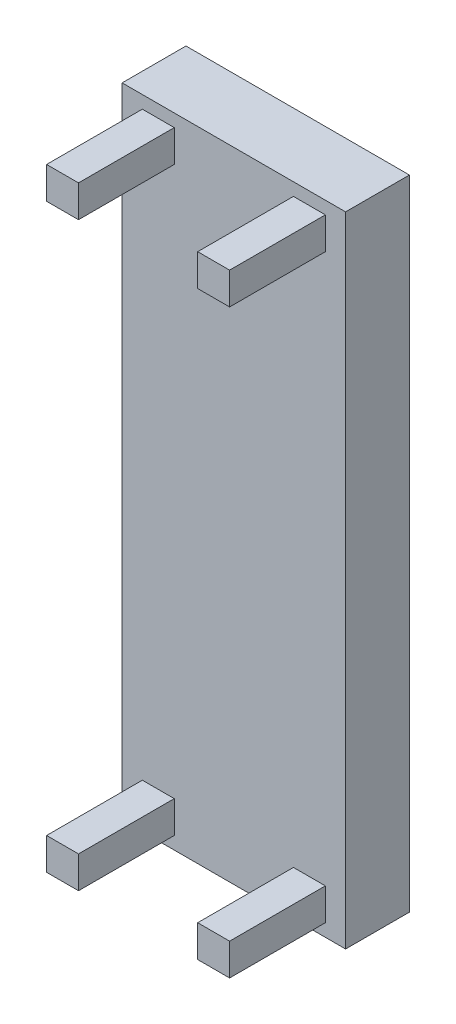
ISO-10303-21;
HEADER;
FILE_DESCRIPTION(('STEP AP214'),'2;1');
FILE_NAME('part.step','',(''),(''),'','','');
FILE_SCHEMA(('AUTOMOTIVE_DESIGN { 1 0 10303 214 1 1 1 1 }'));
ENDSEC;
DATA;
#1=APPLICATION_CONTEXT('core data for automotive mechanical design processes');
#2=APPLICATION_PROTOCOL_DEFINITION('international standard','automotive_design',2000,#1);
#3=PRODUCT_CONTEXT('',#1,'mechanical');
#4=PRODUCT('Part','Part','',(#3));
#5=PRODUCT_RELATED_PRODUCT_CATEGORY('part','',(#4));
#6=PRODUCT_DEFINITION_FORMATION('','',#4);
#7=PRODUCT_DEFINITION_CONTEXT('part definition',#1,'design');
#8=PRODUCT_DEFINITION('design','',#6,#7);
#9=PRODUCT_DEFINITION_SHAPE('','',#8);
#10=(LENGTH_UNIT() NAMED_UNIT(*) SI_UNIT(.MILLI.,.METRE.));
#11=(NAMED_UNIT(*) PLANE_ANGLE_UNIT() SI_UNIT($,.RADIAN.));
#12=(NAMED_UNIT(*) SI_UNIT($,.STERADIAN.) SOLID_ANGLE_UNIT());
#13=UNCERTAINTY_MEASURE_WITH_UNIT(LENGTH_MEASURE(1.E-05),#10,'distance_accuracy_value','');
#14=(GEOMETRIC_REPRESENTATION_CONTEXT(3) GLOBAL_UNCERTAINTY_ASSIGNED_CONTEXT((#13)) GLOBAL_UNIT_ASSIGNED_CONTEXT((#10,
#11,#12)) REPRESENTATION_CONTEXT('',''));
#15=CARTESIAN_POINT('',(0.,0.,0.));
#16=DIRECTION('',(0.,0.,1.));
#17=DIRECTION('',(1.,0.,0.));
#18=AXIS2_PLACEMENT_3D('',#15,#16,#17);
#19=CARTESIAN_POINT('',(0.,0.,200.));
#20=DIRECTION('',(0.,0.,-1.));
#21=DIRECTION('',(-1.,0.,0.));
#22=AXIS2_PLACEMENT_3D('',#19,#20,#21);
#23=PLANE('',#22);
#24=DIRECTION('',(0.,1.,0.));
#25=VECTOR('',#24,1.);
#26=CARTESIAN_POINT('',(286.693905306388,-960.285310824153,200.));
#27=LINE('',#26,#25);
#28=CARTESIAN_POINT('',(286.693905306388,-960.285310824153,200.));
#29=VERTEX_POINT('',#28);
#30=CARTESIAN_POINT('',(286.693905306388,-860.285310824153,200.));
#31=VERTEX_POINT('',#30);
#32=EDGE_CURVE('E227',#29,#31,#27,.T.);
#33=ORIENTED_EDGE('',*,*,#32,.F.);
#34=DIRECTION('',(1.,0.,0.));
#35=VECTOR('',#34,1.);
#36=CARTESIAN_POINT('',(286.693905306388,-960.285310824153,200.));
#37=LINE('',#36,#35);
#38=CARTESIAN_POINT('',(186.693905306388,-960.285310824153,200.));
#39=VERTEX_POINT('',#38);
#40=EDGE_CURVE('E217',#39,#29,#37,.T.);
#41=ORIENTED_EDGE('',*,*,#40,.F.);
#42=DIRECTION('',(0.,-1.,0.));
#43=VECTOR('',#42,1.);
#44=CARTESIAN_POINT('',(186.693905306388,-960.285310824153,200.));
#45=LINE('',#44,#43);
#46=CARTESIAN_POINT('',(186.693905306388,-860.285310824153,200.));
#47=VERTEX_POINT('',#46);
#48=EDGE_CURVE('E220',#47,#39,#45,.T.);
#49=ORIENTED_EDGE('',*,*,#48,.F.);
#50=DIRECTION('',(-1.,0.,0.));
#51=VECTOR('',#50,1.);
#52=CARTESIAN_POINT('',(286.693905306388,-860.285310824153,200.));
#53=LINE('',#52,#51);
#54=EDGE_CURVE('E224',#31,#47,#53,.T.);
#55=ORIENTED_EDGE('',*,*,#54,.F.);
#56=EDGE_LOOP('',(#33,#41,#49,#55));
#57=FACE_BOUND('',#56,.T.);
#58=DIRECTION('',(0.,1.,0.));
#59=VECTOR('',#58,1.);
#60=CARTESIAN_POINT('',(-186.693905306388,960.285310824153,200.));
#61=LINE('',#60,#59);
#62=CARTESIAN_POINT('',(-186.693905306388,860.285310824153,200.));
#63=VERTEX_POINT('',#62);
#64=CARTESIAN_POINT('',(-186.693905306388,960.285310824153,200.));
#65=VERTEX_POINT('',#64);
#66=EDGE_CURVE('E263',#63,#65,#61,.T.);
#67=ORIENTED_EDGE('',*,*,#66,.F.);
#68=DIRECTION('',(1.,0.,0.));
#69=VECTOR('',#68,1.);
#70=CARTESIAN_POINT('',(-286.693905306388,860.285310824153,200.));
#71=LINE('',#70,#69);
#72=CARTESIAN_POINT('',(-286.693905306388,860.285310824153,200.));
#73=VERTEX_POINT('',#72);
#74=EDGE_CURVE('E275',#73,#63,#71,.T.);
#75=ORIENTED_EDGE('',*,*,#74,.F.);
#76=DIRECTION('',(0.,-1.,0.));
#77=VECTOR('',#76,1.);
#78=CARTESIAN_POINT('',(-286.693905306388,960.285310824153,200.));
#79=LINE('',#78,#77);
#80=CARTESIAN_POINT('',(-286.693905306388,960.285310824153,200.));
#81=VERTEX_POINT('',#80);
#82=EDGE_CURVE('E287',#81,#73,#79,.T.);
#83=ORIENTED_EDGE('',*,*,#82,.F.);
#84=DIRECTION('',(-1.,0.,0.));
#85=VECTOR('',#84,1.);
#86=CARTESIAN_POINT('',(-286.693905306388,960.285310824153,200.));
#87=LINE('',#86,#85);
#88=EDGE_CURVE('E284',#65,#81,#87,.T.);
#89=ORIENTED_EDGE('',*,*,#88,.F.);
#90=EDGE_LOOP('',(#67,#75,#83,#89));
#91=FACE_BOUND('',#90,.T.);
#92=DIRECTION('',(0.,1.,0.));
#93=VECTOR('',#92,1.);
#94=CARTESIAN_POINT('',(350.,-1000.,200.));
#95=LINE('',#94,#93);
#96=CARTESIAN_POINT('',(350.,-1000.,200.));
#97=VERTEX_POINT('',#96);
#98=CARTESIAN_POINT('',(350.,1000.,200.));
#99=VERTEX_POINT('',#98);
#100=EDGE_CURVE('E304',#97,#99,#95,.T.);
#101=ORIENTED_EDGE('',*,*,#100,.T.);
#102=DIRECTION('',(-1.,0.,0.));
#103=VECTOR('',#102,1.);
#104=CARTESIAN_POINT('',(-350.,1000.,200.));
#105=LINE('',#104,#103);
#106=CARTESIAN_POINT('',(-350.,1000.,200.));
#107=VERTEX_POINT('',#106);
#108=EDGE_CURVE('E307',#99,#107,#105,.T.);
#109=ORIENTED_EDGE('',*,*,#108,.T.);
#110=DIRECTION('',(0.,-1.,0.));
#111=VECTOR('',#110,1.);
#112=CARTESIAN_POINT('',(-350.,-1000.,200.));
#113=LINE('',#112,#111);
#114=CARTESIAN_POINT('',(-350.,-1000.,200.));
#115=VERTEX_POINT('',#114);
#116=EDGE_CURVE('E310',#107,#115,#113,.T.);
#117=ORIENTED_EDGE('',*,*,#116,.T.);
#118=DIRECTION('',(1.,0.,0.));
#119=VECTOR('',#118,1.);
#120=CARTESIAN_POINT('',(-350.,-1000.,200.));
#121=LINE('',#120,#119);
#122=EDGE_CURVE('E312',#115,#97,#121,.T.);
#123=ORIENTED_EDGE('',*,*,#122,.T.);
#124=EDGE_LOOP('',(#101,#109,#117,#123));
#125=FACE_BOUND('',#124,.T.);
#126=DIRECTION('',(0.,1.,0.));
#127=VECTOR('',#126,1.);
#128=CARTESIAN_POINT('',(286.693905306388,960.285310824153,200.));
#129=LINE('',#128,#127);
#130=CARTESIAN_POINT('',(286.693905306388,860.285310824153,200.));
#131=VERTEX_POINT('',#130);
#132=CARTESIAN_POINT('',(286.693905306388,960.285310824153,200.));
#133=VERTEX_POINT('',#132);
#134=EDGE_CURVE('E260',#131,#133,#129,.T.);
#135=ORIENTED_EDGE('',*,*,#134,.F.);
#136=DIRECTION('',(1.,0.,0.));
#137=VECTOR('',#136,1.);
#138=CARTESIAN_POINT('',(286.693905306388,860.285310824153,200.));
#139=LINE('',#138,#137);
#140=CARTESIAN_POINT('',(186.693905306388,860.285310824153,200.));
#141=VERTEX_POINT('',#140);
#142=EDGE_CURVE('E250',#141,#131,#139,.T.);
#143=ORIENTED_EDGE('',*,*,#142,.F.);
#144=DIRECTION('',(0.,-1.,0.));
#145=VECTOR('',#144,1.);
#146=CARTESIAN_POINT('',(186.693905306388,960.285310824153,200.));
#147=LINE('',#146,#145);
#148=CARTESIAN_POINT('',(186.693905306388,960.285310824153,200.));
#149=VERTEX_POINT('',#148);
#150=EDGE_CURVE('E253',#149,#141,#147,.T.);
#151=ORIENTED_EDGE('',*,*,#150,.F.);
#152=DIRECTION('',(-1.,0.,0.));
#153=VECTOR('',#152,1.);
#154=CARTESIAN_POINT('',(286.693905306388,960.285310824153,200.));
#155=LINE('',#154,#153);
#156=EDGE_CURVE('E257',#133,#149,#155,.T.);
#157=ORIENTED_EDGE('',*,*,#156,.F.);
#158=EDGE_LOOP('',(#135,#143,#151,#157));
#159=FACE_BOUND('',#158,.T.);
#160=DIRECTION('',(0.,-1.,0.));
#161=VECTOR('',#160,1.);
#162=CARTESIAN_POINT('',(-286.693905306388,-960.285310824153,200.));
#163=LINE('',#162,#161);
#164=CARTESIAN_POINT('',(-286.693905306388,-860.285310824153,200.));
#165=VERTEX_POINT('',#164);
#166=CARTESIAN_POINT('',(-286.693905306388,-960.285310824153,200.));
#167=VERTEX_POINT('',#166);
#168=EDGE_CURVE('E170',#165,#167,#163,.T.);
#169=ORIENTED_EDGE('',*,*,#168,.F.);
#170=DIRECTION('',(-1.,0.,0.));
#171=VECTOR('',#170,1.);
#172=CARTESIAN_POINT('',(-286.693905306388,-860.285310824153,200.));
#173=LINE('',#172,#171);
#174=CARTESIAN_POINT('',(-186.693905306388,-860.285310824153,200.));
#175=VERTEX_POINT('',#174);
#176=EDGE_CURVE('E172',#175,#165,#173,.T.);
#177=ORIENTED_EDGE('',*,*,#176,.F.);
#178=DIRECTION('',(0.,1.,0.));
#179=VECTOR('',#178,1.);
#180=CARTESIAN_POINT('',(-186.693905306388,-960.285310824153,200.));
#181=LINE('',#180,#179);
#182=CARTESIAN_POINT('',(-186.693905306388,-960.285310824153,200.));
#183=VERTEX_POINT('',#182);
#184=EDGE_CURVE('E57',#183,#175,#181,.T.);
#185=ORIENTED_EDGE('',*,*,#184,.F.);
#186=DIRECTION('',(1.,0.,0.));
#187=VECTOR('',#186,1.);
#188=CARTESIAN_POINT('',(-286.693905306388,-960.285310824153,200.));
#189=LINE('',#188,#187);
#190=EDGE_CURVE('E52',#167,#183,#189,.T.);
#191=ORIENTED_EDGE('',*,*,#190,.F.);
#192=EDGE_LOOP('',(#169,#177,#185,#191));
#193=FACE_BOUND('',#192,.T.);
#194=ADVANCED_FACE('F37',(#57,#91,#125,#159,#193),#23,.F.);
#195=CARTESIAN_POINT('',(350.,-1000.,200.));
#196=DIRECTION('',(-1.,0.,0.));
#197=DIRECTION('',(0.,0.,1.));
#198=AXIS2_PLACEMENT_3D('',#195,#196,#197);
#199=PLANE('',#198);
#200=DIRECTION('',(0.,1.,0.));
#201=VECTOR('',#200,1.);
#202=CARTESIAN_POINT('',(350.,-1000.,0.));
#203=LINE('',#202,#201);
#204=CARTESIAN_POINT('',(350.,-1000.,0.));
#205=VERTEX_POINT('',#204);
#206=CARTESIAN_POINT('',(350.,1000.,0.));
#207=VERTEX_POINT('',#206);
#208=EDGE_CURVE('E303',#205,#207,#203,.T.);
#209=ORIENTED_EDGE('',*,*,#208,.T.);
#210=DIRECTION('',(0.,0.,-1.));
#211=VECTOR('',#210,1.);
#212=CARTESIAN_POINT('',(350.,1000.,200.));
#213=LINE('',#212,#211);
#214=EDGE_CURVE('E11',#99,#207,#213,.T.);
#215=ORIENTED_EDGE('',*,*,#214,.F.);
#216=ORIENTED_EDGE('',*,*,#100,.F.);
#217=DIRECTION('',(0.,0.,-1.));
#218=VECTOR('',#217,1.);
#219=CARTESIAN_POINT('',(350.,-1000.,200.));
#220=LINE('',#219,#218);
#221=EDGE_CURVE('E314',#97,#205,#220,.T.);
#222=ORIENTED_EDGE('',*,*,#221,.T.);
#223=EDGE_LOOP('',(#209,#215,#216,#222));
#224=FACE_BOUND('',#223,.T.);
#225=ADVANCED_FACE('F39',(#224),#199,.F.);
#226=CARTESIAN_POINT('',(-350.,1000.,200.));
#227=DIRECTION('',(0.,-1.,0.));
#228=DIRECTION('',(0.,0.,-1.));
#229=AXIS2_PLACEMENT_3D('',#226,#227,#228);
#230=PLANE('',#229);
#231=DIRECTION('',(-1.,0.,0.));
#232=VECTOR('',#231,1.);
#233=CARTESIAN_POINT('',(-350.,1000.,0.));
#234=LINE('',#233,#232);
#235=CARTESIAN_POINT('',(-350.,1000.,0.));
#236=VERTEX_POINT('',#235);
#237=EDGE_CURVE('E317',#207,#236,#234,.T.);
#238=ORIENTED_EDGE('',*,*,#237,.T.);
#239=DIRECTION('',(0.,0.,-1.));
#240=VECTOR('',#239,1.);
#241=CARTESIAN_POINT('',(-350.,1000.,200.));
#242=LINE('',#241,#240);
#243=EDGE_CURVE('E45',#107,#236,#242,.T.);
#244=ORIENTED_EDGE('',*,*,#243,.F.);
#245=ORIENTED_EDGE('',*,*,#108,.F.);
#246=ORIENTED_EDGE('',*,*,#214,.T.);
#247=EDGE_LOOP('',(#238,#244,#245,#246));
#248=FACE_BOUND('',#247,.T.);
#249=ADVANCED_FACE('F347',(#248),#230,.F.);
#250=CARTESIAN_POINT('',(-350.,-1000.,200.));
#251=DIRECTION('',(1.,0.,0.));
#252=DIRECTION('',(0.,0.,-1.));
#253=AXIS2_PLACEMENT_3D('',#250,#251,#252);
#254=PLANE('',#253);
#255=DIRECTION('',(0.,-1.,0.));
#256=VECTOR('',#255,1.);
#257=CARTESIAN_POINT('',(-350.,-1000.,0.));
#258=LINE('',#257,#256);
#259=CARTESIAN_POINT('',(-350.,-1000.,0.));
#260=VERTEX_POINT('',#259);
#261=EDGE_CURVE('E319',#236,#260,#258,.T.);
#262=ORIENTED_EDGE('',*,*,#261,.T.);
#263=DIRECTION('',(0.,0.,-1.));
#264=VECTOR('',#263,1.);
#265=CARTESIAN_POINT('',(-350.,-1000.,200.));
#266=LINE('',#265,#264);
#267=EDGE_CURVE('E324',#115,#260,#266,.T.);
#268=ORIENTED_EDGE('',*,*,#267,.F.);
#269=ORIENTED_EDGE('',*,*,#116,.F.);
#270=ORIENTED_EDGE('',*,*,#243,.T.);
#271=EDGE_LOOP('',(#262,#268,#269,#270));
#272=FACE_BOUND('',#271,.T.);
#273=ADVANCED_FACE('F331',(#272),#254,.F.);
#274=CARTESIAN_POINT('',(-350.,-1000.,200.));
#275=DIRECTION('',(0.,1.,0.));
#276=DIRECTION('',(0.,0.,1.));
#277=AXIS2_PLACEMENT_3D('',#274,#275,#276);
#278=PLANE('',#277);
#279=DIRECTION('',(1.,0.,0.));
#280=VECTOR('',#279,1.);
#281=CARTESIAN_POINT('',(-350.,-1000.,0.));
#282=LINE('',#281,#280);
#283=EDGE_CURVE('E308',#260,#205,#282,.T.);
#284=ORIENTED_EDGE('',*,*,#283,.T.);
#285=ORIENTED_EDGE('',*,*,#221,.F.);
#286=ORIENTED_EDGE('',*,*,#122,.F.);
#287=ORIENTED_EDGE('',*,*,#267,.T.);
#288=EDGE_LOOP('',(#284,#285,#286,#287));
#289=FACE_BOUND('',#288,.T.);
#290=ADVANCED_FACE('F340',(#289),#278,.F.);
#291=CARTESIAN_POINT('',(0.,0.,0.));
#292=DIRECTION('',(0.,0.,-1.));
#293=DIRECTION('',(-1.,0.,0.));
#294=AXIS2_PLACEMENT_3D('',#291,#292,#293);
#295=PLANE('',#294);
#296=ORIENTED_EDGE('',*,*,#208,.F.);
#297=ORIENTED_EDGE('',*,*,#283,.F.);
#298=ORIENTED_EDGE('',*,*,#261,.F.);
#299=ORIENTED_EDGE('',*,*,#237,.F.);
#300=EDGE_LOOP('',(#296,#297,#298,#299));
#301=FACE_BOUND('',#300,.T.);
#302=ADVANCED_FACE('F337',(#301),#295,.T.);
#303=CARTESIAN_POINT('',(-186.693905306388,960.285310824153,500.));
#304=DIRECTION('',(-1.,0.,0.));
#305=DIRECTION('',(0.,0.,1.));
#306=AXIS2_PLACEMENT_3D('',#303,#304,#305);
#307=PLANE('',#306);
#308=ORIENTED_EDGE('',*,*,#66,.T.);
#309=DIRECTION('',(0.,0.,-1.));
#310=VECTOR('',#309,1.);
#311=CARTESIAN_POINT('',(-186.693905306388,960.285310824153,500.));
#312=LINE('',#311,#310);
#313=CARTESIAN_POINT('',(-186.693905306388,960.285310824153,500.));
#314=VERTEX_POINT('',#313);
#315=EDGE_CURVE('E300',#314,#65,#312,.T.);
#316=ORIENTED_EDGE('',*,*,#315,.F.);
#317=DIRECTION('',(0.,1.,0.));
#318=VECTOR('',#317,1.);
#319=CARTESIAN_POINT('',(-186.693905306388,960.285310824153,500.));
#320=LINE('',#319,#318);
#321=CARTESIAN_POINT('',(-186.693905306388,860.285310824153,500.));
#322=VERTEX_POINT('',#321);
#323=EDGE_CURVE('E271',#322,#314,#320,.T.);
#324=ORIENTED_EDGE('',*,*,#323,.F.);
#325=DIRECTION('',(0.,0.,-1.));
#326=VECTOR('',#325,1.);
#327=CARTESIAN_POINT('',(-186.693905306388,860.285310824153,500.));
#328=LINE('',#327,#326);
#329=EDGE_CURVE('E281',#322,#63,#328,.T.);
#330=ORIENTED_EDGE('',*,*,#329,.T.);
#331=EDGE_LOOP('',(#308,#316,#324,#330));
#332=FACE_BOUND('',#331,.T.);
#333=ADVANCED_FACE('F362',(#332),#307,.F.);
#334=CARTESIAN_POINT('',(-286.693905306388,960.285310824153,500.));
#335=DIRECTION('',(0.,-1.,0.));
#336=DIRECTION('',(0.,0.,-1.));
#337=AXIS2_PLACEMENT_3D('',#334,#335,#336);
#338=PLANE('',#337);
#339=ORIENTED_EDGE('',*,*,#88,.T.);
#340=DIRECTION('',(0.,0.,-1.));
#341=VECTOR('',#340,1.);
#342=CARTESIAN_POINT('',(-286.693905306388,960.285310824153,500.));
#343=LINE('',#342,#341);
#344=CARTESIAN_POINT('',(-286.693905306388,960.285310824153,500.));
#345=VERTEX_POINT('',#344);
#346=EDGE_CURVE('E297',#345,#81,#343,.T.);
#347=ORIENTED_EDGE('',*,*,#346,.F.);
#348=DIRECTION('',(-1.,0.,0.));
#349=VECTOR('',#348,1.);
#350=CARTESIAN_POINT('',(-286.693905306388,960.285310824153,500.));
#351=LINE('',#350,#349);
#352=EDGE_CURVE('E274',#314,#345,#351,.T.);
#353=ORIENTED_EDGE('',*,*,#352,.F.);
#354=ORIENTED_EDGE('',*,*,#315,.T.);
#355=EDGE_LOOP('',(#339,#347,#353,#354));
#356=FACE_BOUND('',#355,.T.);
#357=ADVANCED_FACE('F381',(#356),#338,.F.);
#358=CARTESIAN_POINT('',(-286.693905306388,960.285310824153,500.));
#359=DIRECTION('',(1.,0.,0.));
#360=DIRECTION('',(0.,0.,-1.));
#361=AXIS2_PLACEMENT_3D('',#358,#359,#360);
#362=PLANE('',#361);
#363=ORIENTED_EDGE('',*,*,#82,.T.);
#364=DIRECTION('',(0.,0.,-1.));
#365=VECTOR('',#364,1.);
#366=CARTESIAN_POINT('',(-286.693905306388,860.285310824153,500.));
#367=LINE('',#366,#365);
#368=CARTESIAN_POINT('',(-286.693905306388,860.285310824153,500.));
#369=VERTEX_POINT('',#368);
#370=EDGE_CURVE('E294',#369,#73,#367,.T.);
#371=ORIENTED_EDGE('',*,*,#370,.F.);
#372=DIRECTION('',(0.,-1.,0.));
#373=VECTOR('',#372,1.);
#374=CARTESIAN_POINT('',(-286.693905306388,960.285310824153,500.));
#375=LINE('',#374,#373);
#376=EDGE_CURVE('E277',#345,#369,#375,.T.);
#377=ORIENTED_EDGE('',*,*,#376,.F.);
#378=ORIENTED_EDGE('',*,*,#346,.T.);
#379=EDGE_LOOP('',(#363,#371,#377,#378));
#380=FACE_BOUND('',#379,.T.);
#381=ADVANCED_FACE('F388',(#380),#362,.F.);
#382=CARTESIAN_POINT('',(-286.693905306388,860.285310824153,500.));
#383=DIRECTION('',(0.,1.,0.));
#384=DIRECTION('',(0.,0.,1.));
#385=AXIS2_PLACEMENT_3D('',#382,#383,#384);
#386=PLANE('',#385);
#387=ORIENTED_EDGE('',*,*,#74,.T.);
#388=ORIENTED_EDGE('',*,*,#329,.F.);
#389=DIRECTION('',(1.,0.,0.));
#390=VECTOR('',#389,1.);
#391=CARTESIAN_POINT('',(-286.693905306388,860.285310824153,500.));
#392=LINE('',#391,#390);
#393=EDGE_CURVE('E279',#369,#322,#392,.T.);
#394=ORIENTED_EDGE('',*,*,#393,.F.);
#395=ORIENTED_EDGE('',*,*,#370,.T.);
#396=EDGE_LOOP('',(#387,#388,#394,#395));
#397=FACE_BOUND('',#396,.T.);
#398=ADVANCED_FACE('F395',(#397),#386,.F.);
#399=CARTESIAN_POINT('',(0.,0.,500.));
#400=DIRECTION('',(0.,0.,1.));
#401=DIRECTION('',(1.,0.,0.));
#402=AXIS2_PLACEMENT_3D('',#399,#400,#401);
#403=PLANE('',#402);
#404=ORIENTED_EDGE('',*,*,#323,.T.);
#405=ORIENTED_EDGE('',*,*,#352,.T.);
#406=ORIENTED_EDGE('',*,*,#376,.T.);
#407=ORIENTED_EDGE('',*,*,#393,.T.);
#408=EDGE_LOOP('',(#404,#405,#406,#407));
#409=FACE_BOUND('',#408,.T.);
#410=ADVANCED_FACE('F403',(#409),#403,.T.);
#411=CARTESIAN_POINT('',(286.693905306388,960.285310824153,500.));
#412=DIRECTION('',(-1.,0.,0.));
#413=DIRECTION('',(0.,0.,1.));
#414=AXIS2_PLACEMENT_3D('',#411,#412,#413);
#415=PLANE('',#414);
#416=ORIENTED_EDGE('',*,*,#134,.T.);
#417=DIRECTION('',(0.,0.,-1.));
#418=VECTOR('',#417,1.);
#419=CARTESIAN_POINT('',(286.693905306388,960.285310824153,500.));
#420=LINE('',#419,#418);
#421=CARTESIAN_POINT('',(286.693905306388,960.285310824153,500.));
#422=VERTEX_POINT('',#421);
#423=EDGE_CURVE('E230',#422,#133,#420,.T.);
#424=ORIENTED_EDGE('',*,*,#423,.F.);
#425=DIRECTION('',(0.,1.,0.));
#426=VECTOR('',#425,1.);
#427=CARTESIAN_POINT('',(286.693905306388,960.285310824153,500.));
#428=LINE('',#427,#426);
#429=CARTESIAN_POINT('',(286.693905306388,860.285310824153,500.));
#430=VERTEX_POINT('',#429);
#431=EDGE_CURVE('E254',#430,#422,#428,.T.);
#432=ORIENTED_EDGE('',*,*,#431,.F.);
#433=DIRECTION('',(0.,0.,-1.));
#434=VECTOR('',#433,1.);
#435=CARTESIAN_POINT('',(286.693905306388,860.285310824153,500.));
#436=LINE('',#435,#434);
#437=EDGE_CURVE('E246',#430,#131,#436,.T.);
#438=ORIENTED_EDGE('',*,*,#437,.T.);
#439=EDGE_LOOP('',(#416,#424,#432,#438));
#440=FACE_BOUND('',#439,.T.);
#441=ADVANCED_FACE('F411',(#440),#415,.F.);
#442=CARTESIAN_POINT('',(286.693905306388,960.285310824153,500.));
#443=DIRECTION('',(0.,-1.,0.));
#444=DIRECTION('',(0.,0.,-1.));
#445=AXIS2_PLACEMENT_3D('',#442,#443,#444);
#446=PLANE('',#445);
#447=ORIENTED_EDGE('',*,*,#156,.T.);
#448=DIRECTION('',(0.,0.,-1.));
#449=VECTOR('',#448,1.);
#450=CARTESIAN_POINT('',(186.693905306388,960.285310824153,500.));
#451=LINE('',#450,#449);
#452=CARTESIAN_POINT('',(186.693905306388,960.285310824153,500.));
#453=VERTEX_POINT('',#452);
#454=EDGE_CURVE('E240',#453,#149,#451,.T.);
#455=ORIENTED_EDGE('',*,*,#454,.F.);
#456=DIRECTION('',(-1.,0.,0.));
#457=VECTOR('',#456,1.);
#458=CARTESIAN_POINT('',(286.693905306388,960.285310824153,500.));
#459=LINE('',#458,#457);
#460=EDGE_CURVE('E267',#422,#453,#459,.T.);
#461=ORIENTED_EDGE('',*,*,#460,.F.);
#462=ORIENTED_EDGE('',*,*,#423,.T.);
#463=EDGE_LOOP('',(#447,#455,#461,#462));
#464=FACE_BOUND('',#463,.T.);
#465=ADVANCED_FACE('F419',(#464),#446,.F.);
#466=CARTESIAN_POINT('',(186.693905306388,960.285310824153,500.));
#467=DIRECTION('',(1.,0.,0.));
#468=DIRECTION('',(0.,0.,-1.));
#469=AXIS2_PLACEMENT_3D('',#466,#467,#468);
#470=PLANE('',#469);
#471=ORIENTED_EDGE('',*,*,#150,.T.);
#472=DIRECTION('',(0.,0.,-1.));
#473=VECTOR('',#472,1.);
#474=CARTESIAN_POINT('',(186.693905306388,860.285310824153,500.));
#475=LINE('',#474,#473);
#476=CARTESIAN_POINT('',(186.693905306388,860.285310824153,500.));
#477=VERTEX_POINT('',#476);
#478=EDGE_CURVE('E243',#477,#141,#475,.T.);
#479=ORIENTED_EDGE('',*,*,#478,.F.);
#480=DIRECTION('',(0.,-1.,0.));
#481=VECTOR('',#480,1.);
#482=CARTESIAN_POINT('',(186.693905306388,960.285310824153,500.));
#483=LINE('',#482,#481);
#484=EDGE_CURVE('E265',#453,#477,#483,.T.);
#485=ORIENTED_EDGE('',*,*,#484,.F.);
#486=ORIENTED_EDGE('',*,*,#454,.T.);
#487=EDGE_LOOP('',(#471,#479,#485,#486));
#488=FACE_BOUND('',#487,.T.);
#489=ADVANCED_FACE('F427',(#488),#470,.F.);
#490=CARTESIAN_POINT('',(286.693905306388,860.285310824153,500.));
#491=DIRECTION('',(0.,1.,0.));
#492=DIRECTION('',(0.,0.,1.));
#493=AXIS2_PLACEMENT_3D('',#490,#491,#492);
#494=PLANE('',#493);
#495=ORIENTED_EDGE('',*,*,#142,.T.);
#496=ORIENTED_EDGE('',*,*,#437,.F.);
#497=DIRECTION('',(1.,0.,0.));
#498=VECTOR('',#497,1.);
#499=CARTESIAN_POINT('',(286.693905306388,860.285310824153,500.));
#500=LINE('',#499,#498);
#501=EDGE_CURVE('E249',#477,#430,#500,.T.);
#502=ORIENTED_EDGE('',*,*,#501,.F.);
#503=ORIENTED_EDGE('',*,*,#478,.T.);
#504=EDGE_LOOP('',(#495,#496,#502,#503));
#505=FACE_BOUND('',#504,.T.);
#506=ADVANCED_FACE('F435',(#505),#494,.F.);
#507=CARTESIAN_POINT('',(0.,0.,500.));
#508=DIRECTION('',(0.,0.,-1.));
#509=DIRECTION('',(-1.,0.,0.));
#510=AXIS2_PLACEMENT_3D('',#507,#508,#509);
#511=PLANE('',#510);
#512=ORIENTED_EDGE('',*,*,#431,.T.);
#513=ORIENTED_EDGE('',*,*,#460,.T.);
#514=ORIENTED_EDGE('',*,*,#484,.T.);
#515=ORIENTED_EDGE('',*,*,#501,.T.);
#516=EDGE_LOOP('',(#512,#513,#514,#515));
#517=FACE_BOUND('',#516,.T.);
#518=ADVANCED_FACE('F443',(#517),#511,.F.);
#519=CARTESIAN_POINT('',(286.693905306388,-960.285310824153,500.));
#520=DIRECTION('',(-1.,0.,0.));
#521=DIRECTION('',(0.,0.,1.));
#522=AXIS2_PLACEMENT_3D('',#519,#520,#521);
#523=PLANE('',#522);
#524=ORIENTED_EDGE('',*,*,#32,.T.);
#525=DIRECTION('',(0.,0.,-1.));
#526=VECTOR('',#525,1.);
#527=CARTESIAN_POINT('',(286.693905306388,-860.285310824153,500.));
#528=LINE('',#527,#526);
#529=CARTESIAN_POINT('',(286.693905306388,-860.285310824153,500.));
#530=VERTEX_POINT('',#529);
#531=EDGE_CURVE('E176',#530,#31,#528,.T.);
#532=ORIENTED_EDGE('',*,*,#531,.F.);
#533=DIRECTION('',(0.,1.,0.));
#534=VECTOR('',#533,1.);
#535=CARTESIAN_POINT('',(286.693905306388,-960.285310824153,500.));
#536=LINE('',#535,#534);
#537=CARTESIAN_POINT('',(286.693905306388,-960.285310824153,500.));
#538=VERTEX_POINT('',#537);
#539=EDGE_CURVE('E221',#538,#530,#536,.T.);
#540=ORIENTED_EDGE('',*,*,#539,.F.);
#541=DIRECTION('',(0.,0.,-1.));
#542=VECTOR('',#541,1.);
#543=CARTESIAN_POINT('',(286.693905306388,-960.285310824153,500.));
#544=LINE('',#543,#542);
#545=EDGE_CURVE('E213',#538,#29,#544,.T.);
#546=ORIENTED_EDGE('',*,*,#545,.T.);
#547=EDGE_LOOP('',(#524,#532,#540,#546));
#548=FACE_BOUND('',#547,.T.);
#549=ADVANCED_FACE('F451',(#548),#523,.F.);
#550=CARTESIAN_POINT('',(286.693905306388,-860.285310824153,500.));
#551=DIRECTION('',(0.,-1.,0.));
#552=DIRECTION('',(0.,0.,-1.));
#553=AXIS2_PLACEMENT_3D('',#550,#551,#552);
#554=PLANE('',#553);
#555=ORIENTED_EDGE('',*,*,#54,.T.);
#556=DIRECTION('',(0.,0.,-1.));
#557=VECTOR('',#556,1.);
#558=CARTESIAN_POINT('',(186.693905306388,-860.285310824153,500.));
#559=LINE('',#558,#557);
#560=CARTESIAN_POINT('',(186.693905306388,-860.285310824153,500.));
#561=VERTEX_POINT('',#560);
#562=EDGE_CURVE('E207',#561,#47,#559,.T.);
#563=ORIENTED_EDGE('',*,*,#562,.F.);
#564=DIRECTION('',(-1.,0.,0.));
#565=VECTOR('',#564,1.);
#566=CARTESIAN_POINT('',(286.693905306388,-860.285310824153,500.));
#567=LINE('',#566,#565);
#568=EDGE_CURVE('E234',#530,#561,#567,.T.);
#569=ORIENTED_EDGE('',*,*,#568,.F.);
#570=ORIENTED_EDGE('',*,*,#531,.T.);
#571=EDGE_LOOP('',(#555,#563,#569,#570));
#572=FACE_BOUND('',#571,.T.);
#573=ADVANCED_FACE('F459',(#572),#554,.F.);
#574=CARTESIAN_POINT('',(186.693905306388,-960.285310824153,500.));
#575=DIRECTION('',(1.,0.,0.));
#576=DIRECTION('',(0.,0.,-1.));
#577=AXIS2_PLACEMENT_3D('',#574,#575,#576);
#578=PLANE('',#577);
#579=ORIENTED_EDGE('',*,*,#48,.T.);
#580=DIRECTION('',(0.,0.,-1.));
#581=VECTOR('',#580,1.);
#582=CARTESIAN_POINT('',(186.693905306388,-960.285310824153,500.));
#583=LINE('',#582,#581);
#584=CARTESIAN_POINT('',(186.693905306388,-960.285310824153,500.));
#585=VERTEX_POINT('',#584);
#586=EDGE_CURVE('E210',#585,#39,#583,.T.);
#587=ORIENTED_EDGE('',*,*,#586,.F.);
#588=DIRECTION('',(0.,-1.,0.));
#589=VECTOR('',#588,1.);
#590=CARTESIAN_POINT('',(186.693905306388,-960.285310824153,500.));
#591=LINE('',#590,#589);
#592=EDGE_CURVE('E232',#561,#585,#591,.T.);
#593=ORIENTED_EDGE('',*,*,#592,.F.);
#594=ORIENTED_EDGE('',*,*,#562,.T.);
#595=EDGE_LOOP('',(#579,#587,#593,#594));
#596=FACE_BOUND('',#595,.T.);
#597=ADVANCED_FACE('F467',(#596),#578,.F.);
#598=CARTESIAN_POINT('',(286.693905306388,-960.285310824153,500.));
#599=DIRECTION('',(0.,1.,0.));
#600=DIRECTION('',(0.,0.,1.));
#601=AXIS2_PLACEMENT_3D('',#598,#599,#600);
#602=PLANE('',#601);
#603=ORIENTED_EDGE('',*,*,#40,.T.);
#604=ORIENTED_EDGE('',*,*,#545,.F.);
#605=DIRECTION('',(1.,0.,0.));
#606=VECTOR('',#605,1.);
#607=CARTESIAN_POINT('',(286.693905306388,-960.285310824153,500.));
#608=LINE('',#607,#606);
#609=EDGE_CURVE('E216',#585,#538,#608,.T.);
#610=ORIENTED_EDGE('',*,*,#609,.F.);
#611=ORIENTED_EDGE('',*,*,#586,.T.);
#612=EDGE_LOOP('',(#603,#604,#610,#611));
#613=FACE_BOUND('',#612,.T.);
#614=ADVANCED_FACE('F475',(#613),#602,.F.);
#615=CARTESIAN_POINT('',(0.,0.,500.));
#616=DIRECTION('',(0.,0.,1.));
#617=DIRECTION('',(1.,0.,0.));
#618=AXIS2_PLACEMENT_3D('',#615,#616,#617);
#619=PLANE('',#618);
#620=ORIENTED_EDGE('',*,*,#539,.T.);
#621=ORIENTED_EDGE('',*,*,#568,.T.);
#622=ORIENTED_EDGE('',*,*,#592,.T.);
#623=ORIENTED_EDGE('',*,*,#609,.T.);
#624=EDGE_LOOP('',(#620,#621,#622,#623));
#625=FACE_BOUND('',#624,.T.);
#626=ADVANCED_FACE('F483',(#625),#619,.T.);
#627=CARTESIAN_POINT('',(-286.693905306388,-960.285310824153,500.));
#628=DIRECTION('',(1.,0.,0.));
#629=DIRECTION('',(0.,0.,-1.));
#630=AXIS2_PLACEMENT_3D('',#627,#628,#629);
#631=PLANE('',#630);
#632=ORIENTED_EDGE('',*,*,#168,.T.);
#633=DIRECTION('',(0.,0.,-1.));
#634=VECTOR('',#633,1.);
#635=CARTESIAN_POINT('',(-286.693905306388,-960.285310824153,500.));
#636=LINE('',#635,#634);
#637=CARTESIAN_POINT('',(-286.693905306388,-960.285310824153,500.));
#638=VERTEX_POINT('',#637);
#639=EDGE_CURVE('E645',#638,#167,#636,.T.);
#640=ORIENTED_EDGE('',*,*,#639,.F.);
#641=DIRECTION('',(0.,-1.,0.));
#642=VECTOR('',#641,1.);
#643=CARTESIAN_POINT('',(-286.693905306388,-960.285310824153,500.));
#644=LINE('',#643,#642);
#645=CARTESIAN_POINT('',(-286.693905306388,-860.285310824153,500.));
#646=VERTEX_POINT('',#645);
#647=EDGE_CURVE('E187',#646,#638,#644,.T.);
#648=ORIENTED_EDGE('',*,*,#647,.F.);
#649=DIRECTION('',(0.,0.,-1.));
#650=VECTOR('',#649,1.);
#651=CARTESIAN_POINT('',(-286.693905306388,-860.285310824153,500.));
#652=LINE('',#651,#650);
#653=EDGE_CURVE('E183',#646,#165,#652,.T.);
#654=ORIENTED_EDGE('',*,*,#653,.T.);
#655=EDGE_LOOP('',(#632,#640,#648,#654));
#656=FACE_BOUND('',#655,.T.);
#657=ADVANCED_FACE('F189',(#656),#631,.F.);
#658=CARTESIAN_POINT('',(-286.693905306388,-960.285310824153,500.));
#659=DIRECTION('',(0.,1.,0.));
#660=DIRECTION('',(0.,0.,1.));
#661=AXIS2_PLACEMENT_3D('',#658,#659,#660);
#662=PLANE('',#661);
#663=ORIENTED_EDGE('',*,*,#190,.T.);
#664=DIRECTION('',(0.,0.,-1.));
#665=VECTOR('',#664,1.);
#666=CARTESIAN_POINT('',(-186.693905306388,-960.285310824153,500.));
#667=LINE('',#666,#665);
#668=CARTESIAN_POINT('',(-186.693905306388,-960.285310824153,500.));
#669=VERTEX_POINT('',#668);
#670=EDGE_CURVE('E195',#669,#183,#667,.T.);
#671=ORIENTED_EDGE('',*,*,#670,.F.);
#672=DIRECTION('',(1.,0.,0.));
#673=VECTOR('',#672,1.);
#674=CARTESIAN_POINT('',(-286.693905306388,-960.285310824153,500.));
#675=LINE('',#674,#673);
#676=EDGE_CURVE('E202',#638,#669,#675,.T.);
#677=ORIENTED_EDGE('',*,*,#676,.F.);
#678=ORIENTED_EDGE('',*,*,#639,.T.);
#679=EDGE_LOOP('',(#663,#671,#677,#678));
#680=FACE_BOUND('',#679,.T.);
#681=ADVANCED_FACE('F498',(#680),#662,.F.);
#682=CARTESIAN_POINT('',(-186.693905306388,-960.285310824153,500.));
#683=DIRECTION('',(-1.,0.,0.));
#684=DIRECTION('',(0.,0.,1.));
#685=AXIS2_PLACEMENT_3D('',#682,#683,#684);
#686=PLANE('',#685);
#687=ORIENTED_EDGE('',*,*,#184,.T.);
#688=DIRECTION('',(0.,0.,-1.));
#689=VECTOR('',#688,1.);
#690=CARTESIAN_POINT('',(-186.693905306388,-860.285310824153,500.));
#691=LINE('',#690,#689);
#692=CARTESIAN_POINT('',(-186.693905306388,-860.285310824153,500.));
#693=VERTEX_POINT('',#692);
#694=EDGE_CURVE('E186',#693,#175,#691,.T.);
#695=ORIENTED_EDGE('',*,*,#694,.F.);
#696=DIRECTION('',(0.,1.,0.));
#697=VECTOR('',#696,1.);
#698=CARTESIAN_POINT('',(-186.693905306388,-960.285310824153,500.));
#699=LINE('',#698,#697);
#700=EDGE_CURVE('E193',#669,#693,#699,.T.);
#701=ORIENTED_EDGE('',*,*,#700,.F.);
#702=ORIENTED_EDGE('',*,*,#670,.T.);
#703=EDGE_LOOP('',(#687,#695,#701,#702));
#704=FACE_BOUND('',#703,.T.);
#705=ADVANCED_FACE('F505',(#704),#686,.F.);
#706=CARTESIAN_POINT('',(-286.693905306388,-860.285310824153,500.));
#707=DIRECTION('',(0.,-1.,0.));
#708=DIRECTION('',(0.,0.,-1.));
#709=AXIS2_PLACEMENT_3D('',#706,#707,#708);
#710=PLANE('',#709);
#711=ORIENTED_EDGE('',*,*,#176,.T.);
#712=ORIENTED_EDGE('',*,*,#653,.F.);
#713=DIRECTION('',(-1.,0.,0.));
#714=VECTOR('',#713,1.);
#715=CARTESIAN_POINT('',(-286.693905306388,-860.285310824153,500.));
#716=LINE('',#715,#714);
#717=EDGE_CURVE('E191',#693,#646,#716,.T.);
#718=ORIENTED_EDGE('',*,*,#717,.F.);
#719=ORIENTED_EDGE('',*,*,#694,.T.);
#720=EDGE_LOOP('',(#711,#712,#718,#719));
#721=FACE_BOUND('',#720,.T.);
#722=ADVANCED_FACE('F181',(#721),#710,.F.);
#723=CARTESIAN_POINT('',(0.,0.,500.));
#724=DIRECTION('',(0.,0.,-1.));
#725=DIRECTION('',(-1.,0.,0.));
#726=AXIS2_PLACEMENT_3D('',#723,#724,#725);
#727=PLANE('',#726);
#728=ORIENTED_EDGE('',*,*,#647,.T.);
#729=ORIENTED_EDGE('',*,*,#676,.T.);
#730=ORIENTED_EDGE('',*,*,#700,.T.);
#731=ORIENTED_EDGE('',*,*,#717,.T.);
#732=EDGE_LOOP('',(#728,#729,#730,#731));
#733=FACE_BOUND('',#732,.T.);
#734=ADVANCED_FACE('F520',(#733),#727,.F.);
#735=CLOSED_SHELL('',(#194,#225,#249,#273,#290,#302,#333,#357,#381,#398,#410,#441,#465,#489,
#506,#518,#549,#573,#597,#614,#626,#657,#681,#705,#722,#734));
#736=MANIFOLD_SOLID_BREP('B2',#735);
#737=ADVANCED_BREP_SHAPE_REPRESENTATION('',(#18,#736),#14);
#738=SHAPE_DEFINITION_REPRESENTATION(#9,#737);
ENDSEC;
END-ISO-10303-21;
